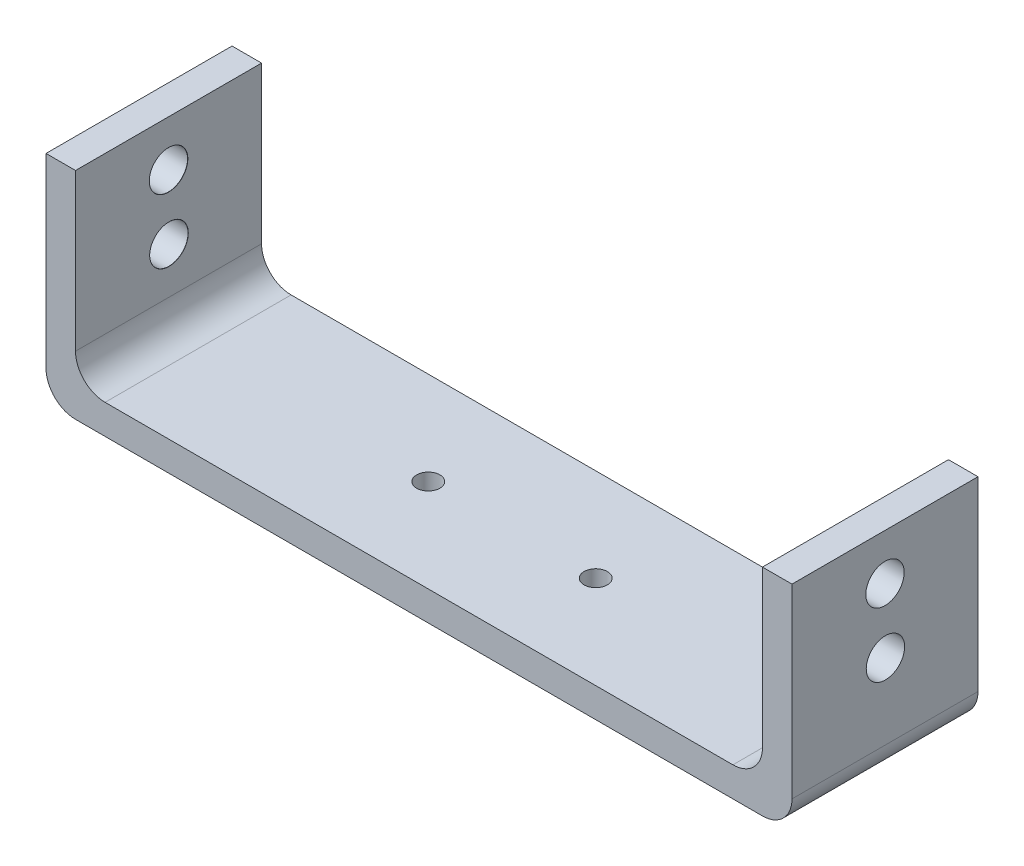
ISO-10303-21;
HEADER;
FILE_DESCRIPTION(('STEP AP214'),'2;1');
FILE_NAME('part.step','',(''),(''),'','','');
FILE_SCHEMA(('AUTOMOTIVE_DESIGN { 1 0 10303 214 1 1 1 1 }'));
ENDSEC;
DATA;
#1=APPLICATION_CONTEXT('core data for automotive mechanical design processes');
#2=APPLICATION_PROTOCOL_DEFINITION('international standard','automotive_design',2000,#1);
#3=PRODUCT_CONTEXT('',#1,'mechanical');
#4=PRODUCT('Part','Part','',(#3));
#5=PRODUCT_RELATED_PRODUCT_CATEGORY('part','',(#4));
#6=PRODUCT_DEFINITION_FORMATION('','',#4);
#7=PRODUCT_DEFINITION_CONTEXT('part definition',#1,'design');
#8=PRODUCT_DEFINITION('design','',#6,#7);
#9=PRODUCT_DEFINITION_SHAPE('','',#8);
#10=(LENGTH_UNIT() NAMED_UNIT(*) SI_UNIT(.MILLI.,.METRE.));
#11=(NAMED_UNIT(*) PLANE_ANGLE_UNIT() SI_UNIT($,.RADIAN.));
#12=(NAMED_UNIT(*) SI_UNIT($,.STERADIAN.) SOLID_ANGLE_UNIT());
#13=UNCERTAINTY_MEASURE_WITH_UNIT(LENGTH_MEASURE(1.E-05),#10,'distance_accuracy_value','');
#14=(GEOMETRIC_REPRESENTATION_CONTEXT(3) GLOBAL_UNCERTAINTY_ASSIGNED_CONTEXT((#13)) GLOBAL_UNIT_ASSIGNED_CONTEXT((#10,
#11,#12)) REPRESENTATION_CONTEXT('',''));
#15=CARTESIAN_POINT('',(0.,0.,0.));
#16=DIRECTION('',(0.,0.,1.));
#17=DIRECTION('',(1.,0.,0.));
#18=AXIS2_PLACEMENT_3D('',#15,#16,#17);
#19=CARTESIAN_POINT('',(-154.05,6.35,0.));
#20=DIRECTION('',(0.,0.,-1.));
#21=DIRECTION('',(-1.,0.,0.));
#22=AXIS2_PLACEMENT_3D('',#19,#20,#21);
#23=PLANE('',#22);
#24=DIRECTION('',(0.,-1.,0.));
#25=VECTOR('',#24,1.);
#26=CARTESIAN_POINT('',(-160.4,6.35,0.));
#27=LINE('',#26,#25);
#28=CARTESIAN_POINT('',(-160.4,46.35,0.));
#29=VERTEX_POINT('',#28);
#30=CARTESIAN_POINT('',(-160.4,6.35,0.));
#31=VERTEX_POINT('',#30);
#32=EDGE_CURVE('E144',#29,#31,#27,.T.);
#33=ORIENTED_EDGE('',*,*,#32,.T.);
#34=CARTESIAN_POINT('',(-154.05,6.35,0.));
#35=DIRECTION('',(0.,0.,-1.));
#36=DIRECTION('',(-1.,0.,0.));
#37=AXIS2_PLACEMENT_3D('',#34,#35,#36);
#38=CIRCLE('',#37,6.35);
#39=CARTESIAN_POINT('',(-154.05,0.,0.));
#40=VERTEX_POINT('',#39);
#41=EDGE_CURVE('E284',#31,#40,#38,.F.);
#42=ORIENTED_EDGE('',*,*,#41,.T.);
#43=DIRECTION('',(1.,0.,0.));
#44=VECTOR('',#43,1.);
#45=CARTESIAN_POINT('',(-154.05,0.,0.));
#46=LINE('',#45,#44);
#47=CARTESIAN_POINT('',(-6.34999999999999,0.,0.));
#48=VERTEX_POINT('',#47);
#49=EDGE_CURVE('E225',#40,#48,#46,.T.);
#50=ORIENTED_EDGE('',*,*,#49,.T.);
#51=CARTESIAN_POINT('',(-6.35,6.35,0.));
#52=DIRECTION('',(0.,0.,-1.));
#53=DIRECTION('',(-1.,0.,0.));
#54=AXIS2_PLACEMENT_3D('',#51,#52,#53);
#55=CIRCLE('',#54,6.35);
#56=CARTESIAN_POINT('',(0.,6.35,0.));
#57=VERTEX_POINT('',#56);
#58=EDGE_CURVE('E257',#48,#57,#55,.F.);
#59=ORIENTED_EDGE('',*,*,#58,.T.);
#60=DIRECTION('',(0.,-1.,0.));
#61=VECTOR('',#60,1.);
#62=CARTESIAN_POINT('',(0.,6.35,0.));
#63=LINE('',#62,#61);
#64=CARTESIAN_POINT('',(0.,46.35,0.));
#65=VERTEX_POINT('',#64);
#66=EDGE_CURVE('E242',#65,#57,#63,.T.);
#67=ORIENTED_EDGE('',*,*,#66,.F.);
#68=DIRECTION('',(1.,0.,0.));
#69=VECTOR('',#68,1.);
#70=CARTESIAN_POINT('',(-6.35,46.35,0.));
#71=LINE('',#70,#69);
#72=CARTESIAN_POINT('',(-6.35,46.35,0.));
#73=VERTEX_POINT('',#72);
#74=EDGE_CURVE('E206',#73,#65,#71,.T.);
#75=ORIENTED_EDGE('',*,*,#74,.F.);
#76=DIRECTION('',(0.,-1.,0.));
#77=VECTOR('',#76,1.);
#78=CARTESIAN_POINT('',(-6.35,46.35,0.));
#79=LINE('',#78,#77);
#80=CARTESIAN_POINT('',(-6.35,12.7,0.));
#81=VERTEX_POINT('',#80);
#82=EDGE_CURVE('E221',#73,#81,#79,.T.);
#83=ORIENTED_EDGE('',*,*,#82,.T.);
#84=CARTESIAN_POINT('',(-12.7,12.7,0.));
#85=DIRECTION('',(0.,0.,-1.));
#86=DIRECTION('',(-1.,0.,0.));
#87=AXIS2_PLACEMENT_3D('',#84,#85,#86);
#88=CIRCLE('',#87,6.35);
#89=CARTESIAN_POINT('',(-12.7,6.35,0.));
#90=VERTEX_POINT('',#89);
#91=EDGE_CURVE('E267',#81,#90,#88,.T.);
#92=ORIENTED_EDGE('',*,*,#91,.T.);
#93=DIRECTION('',(1.,0.,0.));
#94=VECTOR('',#93,1.);
#95=CARTESIAN_POINT('',(-154.05,6.35,0.));
#96=LINE('',#95,#94);
#97=CARTESIAN_POINT('',(-147.7,6.35,0.));
#98=VERTEX_POINT('',#97);
#99=EDGE_CURVE('E226',#98,#90,#96,.T.);
#100=ORIENTED_EDGE('',*,*,#99,.F.);
#101=CARTESIAN_POINT('',(-147.7,12.7,0.));
#102=DIRECTION('',(0.,0.,-1.));
#103=DIRECTION('',(-1.,0.,0.));
#104=AXIS2_PLACEMENT_3D('',#101,#102,#103);
#105=CIRCLE('',#104,6.35);
#106=CARTESIAN_POINT('',(-154.05,12.7,0.));
#107=VERTEX_POINT('',#106);
#108=EDGE_CURVE('E54',#98,#107,#105,.T.);
#109=ORIENTED_EDGE('',*,*,#108,.T.);
#110=DIRECTION('',(0.,-1.,0.));
#111=VECTOR('',#110,1.);
#112=CARTESIAN_POINT('',(-154.05,46.35,0.));
#113=LINE('',#112,#111);
#114=CARTESIAN_POINT('',(-154.05,46.35,0.));
#115=VERTEX_POINT('',#114);
#116=EDGE_CURVE('E145',#115,#107,#113,.T.);
#117=ORIENTED_EDGE('',*,*,#116,.F.);
#118=DIRECTION('',(-1.,0.,0.));
#119=VECTOR('',#118,1.);
#120=CARTESIAN_POINT('',(-154.05,46.35,0.));
#121=LINE('',#120,#119);
#122=EDGE_CURVE('E154',#115,#29,#121,.T.);
#123=ORIENTED_EDGE('',*,*,#122,.T.);
#124=EDGE_LOOP('',(#33,#42,#50,#59,#67,#75,#83,#92,#100,#109,#117,#123));
#125=FACE_BOUND('',#124,.T.);
#126=ADVANCED_FACE('F44',(#125),#23,.F.);
#127=CARTESIAN_POINT('',(0.,6.35,-40.));
#128=DIRECTION('',(-1.,0.,0.));
#129=DIRECTION('',(0.,0.,1.));
#130=AXIS2_PLACEMENT_3D('',#127,#128,#129);
#131=PLANE('',#130);
#132=CARTESIAN_POINT('',(0.,36.467,-20.));
#133=DIRECTION('',(-1.,0.,0.));
#134=DIRECTION('',(0.,0.,1.));
#135=AXIS2_PLACEMENT_3D('',#132,#133,#134);
#136=CIRCLE('',#135,4.125);
#137=CARTESIAN_POINT('',(0.,36.467,-15.875));
#138=VERTEX_POINT('',#137);
#139=EDGE_CURVE('E186',#138,#138,#136,.T.);
#140=ORIENTED_EDGE('',*,*,#139,.T.);
#141=EDGE_LOOP('',(#140));
#142=FACE_BOUND('',#141,.T.);
#143=CARTESIAN_POINT('',(0.,22.583,-20.0935290964698));
#144=DIRECTION('',(-1.,0.,0.));
#145=DIRECTION('',(0.,0.,1.));
#146=AXIS2_PLACEMENT_3D('',#143,#144,#145);
#147=CIRCLE('',#146,4.125);
#148=CARTESIAN_POINT('',(0.,22.583,-15.9685290964698));
#149=VERTEX_POINT('',#148);
#150=EDGE_CURVE('E198',#149,#149,#147,.T.);
#151=ORIENTED_EDGE('',*,*,#150,.T.);
#152=EDGE_LOOP('',(#151));
#153=FACE_BOUND('',#152,.T.);
#154=ORIENTED_EDGE('',*,*,#66,.T.);
#155=DIRECTION('',(0.,0.,-1.));
#156=VECTOR('',#155,1.);
#157=CARTESIAN_POINT('',(0.,6.35,-40.));
#158=LINE('',#157,#156);
#159=CARTESIAN_POINT('',(0.,6.35,-40.));
#160=VERTEX_POINT('',#159);
#161=EDGE_CURVE('E246',#57,#160,#158,.T.);
#162=ORIENTED_EDGE('',*,*,#161,.T.);
#163=DIRECTION('',(0.,-1.,0.));
#164=VECTOR('',#163,1.);
#165=CARTESIAN_POINT('',(0.,6.35,-40.));
#166=LINE('',#165,#164);
#167=CARTESIAN_POINT('',(0.,46.35,-40.));
#168=VERTEX_POINT('',#167);
#169=EDGE_CURVE('E234',#168,#160,#166,.T.);
#170=ORIENTED_EDGE('',*,*,#169,.F.);
#171=DIRECTION('',(0.,0.,-1.));
#172=VECTOR('',#171,1.);
#173=CARTESIAN_POINT('',(0.,46.35,-40.));
#174=LINE('',#173,#172);
#175=EDGE_CURVE('E210',#65,#168,#174,.T.);
#176=ORIENTED_EDGE('',*,*,#175,.F.);
#177=EDGE_LOOP('',(#154,#162,#170,#176));
#178=FACE_BOUND('',#177,.T.);
#179=ADVANCED_FACE('F364',(#142,#153,#178),#131,.F.);
#180=CARTESIAN_POINT('',(-154.05,6.35,-40.));
#181=DIRECTION('',(0.,0.,1.));
#182=DIRECTION('',(1.,0.,0.));
#183=AXIS2_PLACEMENT_3D('',#180,#181,#182);
#184=PLANE('',#183);
#185=DIRECTION('',(-1.,0.,0.));
#186=VECTOR('',#185,1.);
#187=CARTESIAN_POINT('',(-154.05,0.,-40.));
#188=LINE('',#187,#186);
#189=CARTESIAN_POINT('',(-6.34999999999999,0.,-40.));
#190=VERTEX_POINT('',#189);
#191=CARTESIAN_POINT('',(-154.05,0.,-40.));
#192=VERTEX_POINT('',#191);
#193=EDGE_CURVE('E230',#190,#192,#188,.T.);
#194=ORIENTED_EDGE('',*,*,#193,.T.);
#195=CARTESIAN_POINT('',(-154.05,6.35,-40.));
#196=DIRECTION('',(0.,0.,1.));
#197=DIRECTION('',(1.,0.,0.));
#198=AXIS2_PLACEMENT_3D('',#195,#196,#197);
#199=CIRCLE('',#198,6.35);
#200=CARTESIAN_POINT('',(-160.4,6.35,-40.));
#201=VERTEX_POINT('',#200);
#202=EDGE_CURVE('E278',#192,#201,#199,.F.);
#203=ORIENTED_EDGE('',*,*,#202,.T.);
#204=DIRECTION('',(0.,-1.,0.));
#205=VECTOR('',#204,1.);
#206=CARTESIAN_POINT('',(-160.4,6.35,-40.));
#207=LINE('',#206,#205);
#208=CARTESIAN_POINT('',(-160.4,46.35,-40.));
#209=VERTEX_POINT('',#208);
#210=EDGE_CURVE('E161',#209,#201,#207,.T.);
#211=ORIENTED_EDGE('',*,*,#210,.F.);
#212=DIRECTION('',(1.,0.,0.));
#213=VECTOR('',#212,1.);
#214=CARTESIAN_POINT('',(-154.05,46.35,-40.));
#215=LINE('',#214,#213);
#216=CARTESIAN_POINT('',(-154.05,46.35,-40.));
#217=VERTEX_POINT('',#216);
#218=EDGE_CURVE('E151',#209,#217,#215,.T.);
#219=ORIENTED_EDGE('',*,*,#218,.T.);
#220=DIRECTION('',(0.,-1.,0.));
#221=VECTOR('',#220,1.);
#222=CARTESIAN_POINT('',(-154.05,46.35,-40.));
#223=LINE('',#222,#221);
#224=CARTESIAN_POINT('',(-154.05,12.7,-40.));
#225=VERTEX_POINT('',#224);
#226=EDGE_CURVE('E134',#217,#225,#223,.T.);
#227=ORIENTED_EDGE('',*,*,#226,.T.);
#228=CARTESIAN_POINT('',(-147.7,12.7,-40.));
#229=DIRECTION('',(0.,0.,1.));
#230=DIRECTION('',(1.,0.,0.));
#231=AXIS2_PLACEMENT_3D('',#228,#229,#230);
#232=CIRCLE('',#231,6.35);
#233=CARTESIAN_POINT('',(-147.7,6.35,-40.));
#234=VERTEX_POINT('',#233);
#235=EDGE_CURVE('E11',#225,#234,#232,.T.);
#236=ORIENTED_EDGE('',*,*,#235,.T.);
#237=DIRECTION('',(-1.,0.,0.));
#238=VECTOR('',#237,1.);
#239=CARTESIAN_POINT('',(-154.05,6.35,-40.));
#240=LINE('',#239,#238);
#241=CARTESIAN_POINT('',(-12.7,6.35,-40.));
#242=VERTEX_POINT('',#241);
#243=EDGE_CURVE('E229',#242,#234,#240,.T.);
#244=ORIENTED_EDGE('',*,*,#243,.F.);
#245=CARTESIAN_POINT('',(-12.7,12.7,-40.));
#246=DIRECTION('',(0.,0.,1.));
#247=DIRECTION('',(1.,0.,0.));
#248=AXIS2_PLACEMENT_3D('',#245,#246,#247);
#249=CIRCLE('',#248,6.35);
#250=CARTESIAN_POINT('',(-6.35,12.7,-40.));
#251=VERTEX_POINT('',#250);
#252=EDGE_CURVE('E271',#242,#251,#249,.T.);
#253=ORIENTED_EDGE('',*,*,#252,.T.);
#254=DIRECTION('',(0.,-1.,0.));
#255=VECTOR('',#254,1.);
#256=CARTESIAN_POINT('',(-6.35,46.35,-40.));
#257=LINE('',#256,#255);
#258=CARTESIAN_POINT('',(-6.35,46.35,-40.));
#259=VERTEX_POINT('',#258);
#260=EDGE_CURVE('E217',#259,#251,#257,.T.);
#261=ORIENTED_EDGE('',*,*,#260,.F.);
#262=DIRECTION('',(-1.,0.,0.));
#263=VECTOR('',#262,1.);
#264=CARTESIAN_POINT('',(-6.35,46.35,-40.));
#265=LINE('',#264,#263);
#266=EDGE_CURVE('E214',#168,#259,#265,.T.);
#267=ORIENTED_EDGE('',*,*,#266,.F.);
#268=ORIENTED_EDGE('',*,*,#169,.T.);
#269=CARTESIAN_POINT('',(-6.35,6.35,-40.));
#270=DIRECTION('',(0.,0.,1.));
#271=DIRECTION('',(1.,0.,0.));
#272=AXIS2_PLACEMENT_3D('',#269,#270,#271);
#273=CIRCLE('',#272,6.35);
#274=EDGE_CURVE('E250',#160,#190,#273,.F.);
#275=ORIENTED_EDGE('',*,*,#274,.T.);
#276=EDGE_LOOP('',(#194,#203,#211,#219,#227,#236,#244,#253,#261,#267,#268,#275));
#277=FACE_BOUND('',#276,.T.);
#278=ADVANCED_FACE('F159',(#277),#184,.F.);
#279=CARTESIAN_POINT('',(0.,6.35,0.));
#280=DIRECTION('',(0.,1.,0.));
#281=DIRECTION('',(0.,0.,1.));
#282=AXIS2_PLACEMENT_3D('',#279,#280,#281);
#283=PLANE('',#282);
#284=CARTESIAN_POINT('',(-98.2,6.35,-20.));
#285=DIRECTION('',(0.,1.,0.));
#286=DIRECTION('',(0.,0.,1.));
#287=AXIS2_PLACEMENT_3D('',#284,#285,#286);
#288=CIRCLE('',#287,2.5);
#289=CARTESIAN_POINT('',(-98.2,6.35,-17.5));
#290=VERTEX_POINT('',#289);
#291=EDGE_CURVE('E296',#290,#290,#288,.T.);
#292=ORIENTED_EDGE('',*,*,#291,.F.);
#293=EDGE_LOOP('',(#292));
#294=FACE_BOUND('',#293,.T.);
#295=CARTESIAN_POINT('',(-62.2,6.35,-20.));
#296=DIRECTION('',(0.,1.,0.));
#297=DIRECTION('',(0.,0.,1.));
#298=AXIS2_PLACEMENT_3D('',#295,#296,#297);
#299=CIRCLE('',#298,2.50000000000001);
#300=CARTESIAN_POINT('',(-62.2,6.35,-17.5));
#301=VERTEX_POINT('',#300);
#302=EDGE_CURVE('E304',#301,#301,#299,.T.);
#303=ORIENTED_EDGE('',*,*,#302,.F.);
#304=EDGE_LOOP('',(#303));
#305=FACE_BOUND('',#304,.T.);
#306=ORIENTED_EDGE('',*,*,#243,.T.);
#307=DIRECTION('',(0.,0.,1.));
#308=VECTOR('',#307,1.);
#309=CARTESIAN_POINT('',(-147.7,6.35,0.));
#310=LINE('',#309,#308);
#311=EDGE_CURVE('E287',#234,#98,#310,.T.);
#312=ORIENTED_EDGE('',*,*,#311,.T.);
#313=ORIENTED_EDGE('',*,*,#99,.T.);
#314=DIRECTION('',(0.,0.,1.));
#315=VECTOR('',#314,1.);
#316=CARTESIAN_POINT('',(-12.7,6.35,0.));
#317=LINE('',#316,#315);
#318=EDGE_CURVE('E264',#90,#242,#317,.F.);
#319=ORIENTED_EDGE('',*,*,#318,.T.);
#320=EDGE_LOOP('',(#306,#312,#313,#319));
#321=FACE_BOUND('',#320,.T.);
#322=ADVANCED_FACE('F411',(#294,#305,#321),#283,.T.);
#323=CARTESIAN_POINT('',(0.,0.,0.));
#324=DIRECTION('',(0.,1.,0.));
#325=DIRECTION('',(0.,0.,1.));
#326=AXIS2_PLACEMENT_3D('',#323,#324,#325);
#327=PLANE('',#326);
#328=CARTESIAN_POINT('',(-98.2,0.,-20.));
#329=DIRECTION('',(0.,1.,0.));
#330=DIRECTION('',(0.,0.,1.));
#331=AXIS2_PLACEMENT_3D('',#328,#329,#330);
#332=CIRCLE('',#331,2.5);
#333=CARTESIAN_POINT('',(-98.2,0.,-17.5));
#334=VERTEX_POINT('',#333);
#335=EDGE_CURVE('E48',#334,#334,#332,.T.);
#336=ORIENTED_EDGE('',*,*,#335,.T.);
#337=EDGE_LOOP('',(#336));
#338=FACE_BOUND('',#337,.T.);
#339=CARTESIAN_POINT('',(-62.2,0.,-20.));
#340=DIRECTION('',(0.,1.,0.));
#341=DIRECTION('',(0.,0.,1.));
#342=AXIS2_PLACEMENT_3D('',#339,#340,#341);
#343=CIRCLE('',#342,2.50000000000001);
#344=CARTESIAN_POINT('',(-62.2,0.,-17.5));
#345=VERTEX_POINT('',#344);
#346=EDGE_CURVE('E293',#345,#345,#343,.T.);
#347=ORIENTED_EDGE('',*,*,#346,.T.);
#348=EDGE_LOOP('',(#347));
#349=FACE_BOUND('',#348,.T.);
#350=ORIENTED_EDGE('',*,*,#49,.F.);
#351=DIRECTION('',(0.,0.,-1.));
#352=VECTOR('',#351,1.);
#353=CARTESIAN_POINT('',(-154.05,0.,-40.));
#354=LINE('',#353,#352);
#355=EDGE_CURVE('E274',#40,#192,#354,.T.);
#356=ORIENTED_EDGE('',*,*,#355,.T.);
#357=ORIENTED_EDGE('',*,*,#193,.F.);
#358=DIRECTION('',(0.,0.,-1.));
#359=VECTOR('',#358,1.);
#360=CARTESIAN_POINT('',(-6.35,0.,0.));
#361=LINE('',#360,#359);
#362=EDGE_CURVE('E253',#190,#48,#361,.F.);
#363=ORIENTED_EDGE('',*,*,#362,.T.);
#364=EDGE_LOOP('',(#350,#356,#357,#363));
#365=FACE_BOUND('',#364,.T.);
#366=ADVANCED_FACE('F392',(#338,#349,#365),#327,.F.);
#367=CARTESIAN_POINT('',(-6.35,46.35,-40.));
#368=DIRECTION('',(1.,0.,0.));
#369=DIRECTION('',(0.,0.,-1.));
#370=AXIS2_PLACEMENT_3D('',#367,#368,#369);
#371=PLANE('',#370);
#372=CARTESIAN_POINT('',(-6.35,36.467,-20.));
#373=DIRECTION('',(-1.,0.,0.));
#374=DIRECTION('',(0.,0.,1.));
#375=AXIS2_PLACEMENT_3D('',#372,#373,#374);
#376=CIRCLE('',#375,4.15);
#377=CARTESIAN_POINT('',(-6.35,36.467,-15.85));
#378=VERTEX_POINT('',#377);
#379=EDGE_CURVE('E178',#378,#378,#376,.T.);
#380=ORIENTED_EDGE('',*,*,#379,.F.);
#381=EDGE_LOOP('',(#380));
#382=FACE_BOUND('',#381,.T.);
#383=CARTESIAN_POINT('',(-6.35,22.583,-20.0935290964698));
#384=DIRECTION('',(-1.,0.,0.));
#385=DIRECTION('',(0.,0.,1.));
#386=AXIS2_PLACEMENT_3D('',#383,#384,#385);
#387=CIRCLE('',#386,4.15);
#388=CARTESIAN_POINT('',(-6.35,22.583,-15.9435290964698));
#389=VERTEX_POINT('',#388);
#390=EDGE_CURVE('E190',#389,#389,#387,.T.);
#391=ORIENTED_EDGE('',*,*,#390,.F.);
#392=EDGE_LOOP('',(#391));
#393=FACE_BOUND('',#392,.T.);
#394=ORIENTED_EDGE('',*,*,#260,.T.);
#395=DIRECTION('',(0.,0.,1.));
#396=VECTOR('',#395,1.);
#397=CARTESIAN_POINT('',(-6.35,12.7,-40.));
#398=LINE('',#397,#396);
#399=EDGE_CURVE('E260',#251,#81,#398,.T.);
#400=ORIENTED_EDGE('',*,*,#399,.T.);
#401=ORIENTED_EDGE('',*,*,#82,.F.);
#402=DIRECTION('',(0.,0.,1.));
#403=VECTOR('',#402,1.);
#404=CARTESIAN_POINT('',(-6.35,46.35,-40.));
#405=LINE('',#404,#403);
#406=EDGE_CURVE('E202',#259,#73,#405,.T.);
#407=ORIENTED_EDGE('',*,*,#406,.F.);
#408=EDGE_LOOP('',(#394,#400,#401,#407));
#409=FACE_BOUND('',#408,.T.);
#410=ADVANCED_FACE('F408',(#382,#393,#409),#371,.F.);
#411=CARTESIAN_POINT('',(0.,46.35,0.));
#412=DIRECTION('',(0.,1.,0.));
#413=DIRECTION('',(0.,0.,1.));
#414=AXIS2_PLACEMENT_3D('',#411,#412,#413);
#415=PLANE('',#414);
#416=ORIENTED_EDGE('',*,*,#406,.T.);
#417=ORIENTED_EDGE('',*,*,#74,.T.);
#418=ORIENTED_EDGE('',*,*,#175,.T.);
#419=ORIENTED_EDGE('',*,*,#266,.T.);
#420=EDGE_LOOP('',(#416,#417,#418,#419));
#421=FACE_BOUND('',#420,.T.);
#422=ADVANCED_FACE('F377',(#421),#415,.T.);
#423=CARTESIAN_POINT('',(-6.35,6.35,-40.));
#424=DIRECTION('',(0.,0.,-1.));
#425=DIRECTION('',(-1.,0.,0.));
#426=AXIS2_PLACEMENT_3D('',#423,#424,#425);
#427=CYLINDRICAL_SURFACE('',#426,6.35);
#428=ORIENTED_EDGE('',*,*,#58,.F.);
#429=ORIENTED_EDGE('',*,*,#362,.F.);
#430=ORIENTED_EDGE('',*,*,#274,.F.);
#431=ORIENTED_EDGE('',*,*,#161,.F.);
#432=EDGE_LOOP('',(#428,#429,#430,#431));
#433=FACE_BOUND('',#432,.T.);
#434=ADVANCED_FACE('F373',(#433),#427,.T.);
#435=CARTESIAN_POINT('',(-12.7,12.7,-40.));
#436=DIRECTION('',(0.,0.,1.));
#437=DIRECTION('',(1.,0.,0.));
#438=AXIS2_PLACEMENT_3D('',#435,#436,#437);
#439=CYLINDRICAL_SURFACE('',#438,6.35);
#440=ORIENTED_EDGE('',*,*,#252,.F.);
#441=ORIENTED_EDGE('',*,*,#318,.F.);
#442=ORIENTED_EDGE('',*,*,#91,.F.);
#443=ORIENTED_EDGE('',*,*,#399,.F.);
#444=EDGE_LOOP('',(#440,#441,#442,#443));
#445=FACE_BOUND('',#444,.T.);
#446=ADVANCED_FACE('F376',(#445),#439,.F.);
#447=CARTESIAN_POINT('',(-6.35,22.583,-20.0935290964698));
#448=DIRECTION('',(-1.,0.,0.));
#449=DIRECTION('',(0.,0.,1.));
#450=AXIS2_PLACEMENT_3D('',#447,#448,#449);
#451=CYLINDRICAL_SURFACE('',#450,4.12499999999999);
#452=ORIENTED_EDGE('',*,*,#150,.F.);
#453=EDGE_LOOP('',(#452));
#454=FACE_BOUND('',#453,.T.);
#455=CARTESIAN_POINT('',(-6.32499999999997,22.583,-20.0935290964698));
#456=DIRECTION('',(-1.,0.,0.));
#457=DIRECTION('',(0.,0.,1.));
#458=AXIS2_PLACEMENT_3D('',#455,#456,#457);
#459=CIRCLE('',#458,4.12499999999999);
#460=CARTESIAN_POINT('',(-6.32499999999997,22.583,-15.9685290964698));
#461=VERTEX_POINT('',#460);
#462=EDGE_CURVE('E194',#461,#461,#459,.T.);
#463=ORIENTED_EDGE('',*,*,#462,.T.);
#464=EDGE_LOOP('',(#463));
#465=FACE_BOUND('',#464,.T.);
#466=ADVANCED_FACE('F380',(#454,#465),#451,.F.);
#467=CARTESIAN_POINT('',(-6.35,22.583,-20.0935290964698));
#468=DIRECTION('',(-1.,0.,0.));
#469=DIRECTION('',(0.,0.,1.));
#470=AXIS2_PLACEMENT_3D('',#467,#468,#469);
#471=CONICAL_SURFACE('',#470,4.15,0.785398163397205);
#472=ORIENTED_EDGE('',*,*,#462,.F.);
#473=EDGE_LOOP('',(#472));
#474=FACE_BOUND('',#473,.T.);
#475=ORIENTED_EDGE('',*,*,#390,.T.);
#476=EDGE_LOOP('',(#475));
#477=FACE_BOUND('',#476,.T.);
#478=ADVANCED_FACE('F431',(#474,#477),#471,.F.);
#479=CARTESIAN_POINT('',(-6.35,36.467,-20.));
#480=DIRECTION('',(-1.,0.,0.));
#481=DIRECTION('',(0.,0.,1.));
#482=AXIS2_PLACEMENT_3D('',#479,#480,#481);
#483=CYLINDRICAL_SURFACE('',#482,4.125);
#484=ORIENTED_EDGE('',*,*,#139,.F.);
#485=EDGE_LOOP('',(#484));
#486=FACE_BOUND('',#485,.T.);
#487=CARTESIAN_POINT('',(-6.32499999999997,36.467,-20.));
#488=DIRECTION('',(-1.,0.,0.));
#489=DIRECTION('',(0.,0.,1.));
#490=AXIS2_PLACEMENT_3D('',#487,#488,#489);
#491=CIRCLE('',#490,4.12499999999999);
#492=CARTESIAN_POINT('',(-6.32499999999997,36.467,-15.875));
#493=VERTEX_POINT('',#492);
#494=EDGE_CURVE('E182',#493,#493,#491,.T.);
#495=ORIENTED_EDGE('',*,*,#494,.T.);
#496=EDGE_LOOP('',(#495));
#497=FACE_BOUND('',#496,.T.);
#498=ADVANCED_FACE('F435',(#486,#497),#483,.F.);
#499=CARTESIAN_POINT('',(-6.35,36.467,-20.));
#500=DIRECTION('',(-1.,0.,0.));
#501=DIRECTION('',(0.,0.,1.));
#502=AXIS2_PLACEMENT_3D('',#499,#500,#501);
#503=CONICAL_SURFACE('',#502,4.15,0.785398163397136);
#504=ORIENTED_EDGE('',*,*,#494,.F.);
#505=EDGE_LOOP('',(#504));
#506=FACE_BOUND('',#505,.T.);
#507=ORIENTED_EDGE('',*,*,#379,.T.);
#508=EDGE_LOOP('',(#507));
#509=FACE_BOUND('',#508,.T.);
#510=ADVANCED_FACE('F359',(#506,#509),#503,.F.);
#511=CARTESIAN_POINT('',(-160.4,6.35,-40.));
#512=DIRECTION('',(-1.,0.,0.));
#513=DIRECTION('',(0.,0.,1.));
#514=AXIS2_PLACEMENT_3D('',#511,#512,#513);
#515=PLANE('',#514);
#516=CARTESIAN_POINT('',(-160.4,36.467,-20.));
#517=DIRECTION('',(1.,0.,0.));
#518=DIRECTION('',(0.,0.,-1.));
#519=AXIS2_PLACEMENT_3D('',#516,#517,#518);
#520=CIRCLE('',#519,4.125);
#521=CARTESIAN_POINT('',(-160.4,36.467,-24.125));
#522=VERTEX_POINT('',#521);
#523=EDGE_CURVE('E319',#522,#522,#520,.T.);
#524=ORIENTED_EDGE('',*,*,#523,.T.);
#525=EDGE_LOOP('',(#524));
#526=FACE_BOUND('',#525,.T.);
#527=CARTESIAN_POINT('',(-160.4,22.583,-20.0935290964697));
#528=DIRECTION('',(1.,0.,0.));
#529=DIRECTION('',(0.,0.,-1.));
#530=AXIS2_PLACEMENT_3D('',#527,#528,#529);
#531=CIRCLE('',#530,4.125);
#532=CARTESIAN_POINT('',(-160.4,22.583,-24.2185290964697));
#533=VERTEX_POINT('',#532);
#534=EDGE_CURVE('E156',#533,#533,#531,.T.);
#535=ORIENTED_EDGE('',*,*,#534,.T.);
#536=EDGE_LOOP('',(#535));
#537=FACE_BOUND('',#536,.T.);
#538=ORIENTED_EDGE('',*,*,#210,.T.);
#539=DIRECTION('',(0.,0.,-1.));
#540=VECTOR('',#539,1.);
#541=CARTESIAN_POINT('',(-160.4,6.35,0.));
#542=LINE('',#541,#540);
#543=EDGE_CURVE('E281',#201,#31,#542,.F.);
#544=ORIENTED_EDGE('',*,*,#543,.T.);
#545=ORIENTED_EDGE('',*,*,#32,.F.);
#546=DIRECTION('',(0.,0.,-1.));
#547=VECTOR('',#546,1.);
#548=CARTESIAN_POINT('',(-160.4,46.35,-40.));
#549=LINE('',#548,#547);
#550=EDGE_CURVE('E163',#29,#209,#549,.T.);
#551=ORIENTED_EDGE('',*,*,#550,.T.);
#552=EDGE_LOOP('',(#538,#544,#545,#551));
#553=FACE_BOUND('',#552,.T.);
#554=ADVANCED_FACE('F334',(#526,#537,#553),#515,.T.);
#555=CARTESIAN_POINT('',(-154.05,46.35,-40.));
#556=DIRECTION('',(1.,0.,0.));
#557=DIRECTION('',(0.,0.,-1.));
#558=AXIS2_PLACEMENT_3D('',#555,#556,#557);
#559=PLANE('',#558);
#560=CARTESIAN_POINT('',(-154.05,36.467,-20.));
#561=DIRECTION('',(1.,0.,0.));
#562=DIRECTION('',(0.,0.,-1.));
#563=AXIS2_PLACEMENT_3D('',#560,#561,#562);
#564=CIRCLE('',#563,4.15);
#565=CARTESIAN_POINT('',(-154.05,36.467,-24.15));
#566=VERTEX_POINT('',#565);
#567=EDGE_CURVE('E302',#566,#566,#564,.T.);
#568=ORIENTED_EDGE('',*,*,#567,.F.);
#569=EDGE_LOOP('',(#568));
#570=FACE_BOUND('',#569,.T.);
#571=CARTESIAN_POINT('',(-154.05,22.583,-20.0935290964697));
#572=DIRECTION('',(1.,0.,0.));
#573=DIRECTION('',(0.,0.,-1.));
#574=AXIS2_PLACEMENT_3D('',#571,#572,#573);
#575=CIRCLE('',#574,4.15);
#576=CARTESIAN_POINT('',(-154.05,22.583,-24.2435290964697));
#577=VERTEX_POINT('',#576);
#578=EDGE_CURVE('E323',#577,#577,#575,.T.);
#579=ORIENTED_EDGE('',*,*,#578,.F.);
#580=EDGE_LOOP('',(#579));
#581=FACE_BOUND('',#580,.T.);
#582=ORIENTED_EDGE('',*,*,#116,.T.);
#583=DIRECTION('',(0.,0.,1.));
#584=VECTOR('',#583,1.);
#585=CARTESIAN_POINT('',(-154.05,12.7,-40.));
#586=LINE('',#585,#584);
#587=EDGE_CURVE('E139',#107,#225,#586,.F.);
#588=ORIENTED_EDGE('',*,*,#587,.T.);
#589=ORIENTED_EDGE('',*,*,#226,.F.);
#590=DIRECTION('',(0.,0.,1.));
#591=VECTOR('',#590,1.);
#592=CARTESIAN_POINT('',(-154.05,46.35,-40.));
#593=LINE('',#592,#591);
#594=EDGE_CURVE('E137',#217,#115,#593,.T.);
#595=ORIENTED_EDGE('',*,*,#594,.T.);
#596=EDGE_LOOP('',(#582,#588,#589,#595));
#597=FACE_BOUND('',#596,.T.);
#598=ADVANCED_FACE('F136',(#570,#581,#597),#559,.T.);
#599=CARTESIAN_POINT('',(-160.4,46.35,0.));
#600=DIRECTION('',(0.,1.,0.));
#601=DIRECTION('',(0.,0.,1.));
#602=AXIS2_PLACEMENT_3D('',#599,#600,#601);
#603=PLANE('',#602);
#604=ORIENTED_EDGE('',*,*,#594,.F.);
#605=ORIENTED_EDGE('',*,*,#218,.F.);
#606=ORIENTED_EDGE('',*,*,#550,.F.);
#607=ORIENTED_EDGE('',*,*,#122,.F.);
#608=EDGE_LOOP('',(#604,#605,#606,#607));
#609=FACE_BOUND('',#608,.T.);
#610=ADVANCED_FACE('F149',(#609),#603,.T.);
#611=CARTESIAN_POINT('',(-154.05,6.35,0.));
#612=DIRECTION('',(0.,0.,1.));
#613=DIRECTION('',(1.,0.,0.));
#614=AXIS2_PLACEMENT_3D('',#611,#612,#613);
#615=CYLINDRICAL_SURFACE('',#614,6.35);
#616=ORIENTED_EDGE('',*,*,#41,.F.);
#617=ORIENTED_EDGE('',*,*,#543,.F.);
#618=ORIENTED_EDGE('',*,*,#202,.F.);
#619=ORIENTED_EDGE('',*,*,#355,.F.);
#620=EDGE_LOOP('',(#616,#617,#618,#619));
#621=FACE_BOUND('',#620,.T.);
#622=ADVANCED_FACE('F357',(#621),#615,.T.);
#623=CARTESIAN_POINT('',(-147.7,12.7,0.));
#624=DIRECTION('',(0.,0.,-1.));
#625=DIRECTION('',(-1.,0.,0.));
#626=AXIS2_PLACEMENT_3D('',#623,#624,#625);
#627=CYLINDRICAL_SURFACE('',#626,6.35);
#628=ORIENTED_EDGE('',*,*,#235,.F.);
#629=ORIENTED_EDGE('',*,*,#587,.F.);
#630=ORIENTED_EDGE('',*,*,#108,.F.);
#631=ORIENTED_EDGE('',*,*,#311,.F.);
#632=EDGE_LOOP('',(#628,#629,#630,#631));
#633=FACE_BOUND('',#632,.T.);
#634=ADVANCED_FACE('F46',(#633),#627,.F.);
#635=CARTESIAN_POINT('',(-154.05,22.583,-20.0935290964697));
#636=DIRECTION('',(1.,0.,0.));
#637=DIRECTION('',(0.,0.,-1.));
#638=AXIS2_PLACEMENT_3D('',#635,#636,#637);
#639=CYLINDRICAL_SURFACE('',#638,4.12499999999999);
#640=ORIENTED_EDGE('',*,*,#534,.F.);
#641=EDGE_LOOP('',(#640));
#642=FACE_BOUND('',#641,.T.);
#643=CARTESIAN_POINT('',(-154.075,22.583,-20.0935290964697));
#644=DIRECTION('',(1.,0.,0.));
#645=DIRECTION('',(0.,0.,-1.));
#646=AXIS2_PLACEMENT_3D('',#643,#644,#645);
#647=CIRCLE('',#646,4.12499999999999);
#648=CARTESIAN_POINT('',(-154.075,22.583,-24.2185290964697));
#649=VERTEX_POINT('',#648);
#650=EDGE_CURVE('E327',#649,#649,#647,.T.);
#651=ORIENTED_EDGE('',*,*,#650,.T.);
#652=EDGE_LOOP('',(#651));
#653=FACE_BOUND('',#652,.T.);
#654=ADVANCED_FACE('F337',(#642,#653),#639,.F.);
#655=CARTESIAN_POINT('',(-154.05,22.583,-20.0935290964697));
#656=DIRECTION('',(1.,0.,0.));
#657=DIRECTION('',(0.,0.,-1.));
#658=AXIS2_PLACEMENT_3D('',#655,#656,#657);
#659=CONICAL_SURFACE('',#658,4.15,0.78539816339724);
#660=ORIENTED_EDGE('',*,*,#650,.F.);
#661=EDGE_LOOP('',(#660));
#662=FACE_BOUND('',#661,.T.);
#663=ORIENTED_EDGE('',*,*,#578,.T.);
#664=EDGE_LOOP('',(#663));
#665=FACE_BOUND('',#664,.T.);
#666=ADVANCED_FACE('F340',(#662,#665),#659,.F.);
#667=CARTESIAN_POINT('',(-154.05,36.467,-20.));
#668=DIRECTION('',(1.,0.,0.));
#669=DIRECTION('',(0.,0.,-1.));
#670=AXIS2_PLACEMENT_3D('',#667,#668,#669);
#671=CYLINDRICAL_SURFACE('',#670,4.125);
#672=ORIENTED_EDGE('',*,*,#523,.F.);
#673=EDGE_LOOP('',(#672));
#674=FACE_BOUND('',#673,.T.);
#675=CARTESIAN_POINT('',(-154.075,36.467,-20.));
#676=DIRECTION('',(1.,0.,0.));
#677=DIRECTION('',(0.,0.,-1.));
#678=AXIS2_PLACEMENT_3D('',#675,#676,#677);
#679=CIRCLE('',#678,4.12499999999999);
#680=CARTESIAN_POINT('',(-154.075,36.467,-24.125));
#681=VERTEX_POINT('',#680);
#682=EDGE_CURVE('E315',#681,#681,#679,.T.);
#683=ORIENTED_EDGE('',*,*,#682,.T.);
#684=EDGE_LOOP('',(#683));
#685=FACE_BOUND('',#684,.T.);
#686=ADVANCED_FACE('F346',(#674,#685),#671,.F.);
#687=CARTESIAN_POINT('',(-154.05,36.467,-20.));
#688=DIRECTION('',(1.,0.,0.));
#689=DIRECTION('',(0.,0.,-1.));
#690=AXIS2_PLACEMENT_3D('',#687,#688,#689);
#691=CONICAL_SURFACE('',#690,4.15,0.785398163397171);
#692=ORIENTED_EDGE('',*,*,#682,.F.);
#693=EDGE_LOOP('',(#692));
#694=FACE_BOUND('',#693,.T.);
#695=ORIENTED_EDGE('',*,*,#567,.T.);
#696=EDGE_LOOP('',(#695));
#697=FACE_BOUND('',#696,.T.);
#698=ADVANCED_FACE('F507',(#694,#697),#691,.F.);
#699=CARTESIAN_POINT('',(-62.2,-33.65,-20.));
#700=DIRECTION('',(0.,1.,0.));
#701=DIRECTION('',(0.,0.,1.));
#702=AXIS2_PLACEMENT_3D('',#699,#700,#701);
#703=CYLINDRICAL_SURFACE('',#702,2.50000000000001);
#704=ORIENTED_EDGE('',*,*,#302,.T.);
#705=EDGE_LOOP('',(#704));
#706=FACE_BOUND('',#705,.T.);
#707=ORIENTED_EDGE('',*,*,#346,.F.);
#708=EDGE_LOOP('',(#707));
#709=FACE_BOUND('',#708,.T.);
#710=ADVANCED_FACE('F517',(#706,#709),#703,.F.);
#711=CARTESIAN_POINT('',(-98.2,-33.65,-20.));
#712=DIRECTION('',(0.,1.,0.));
#713=DIRECTION('',(0.,0.,1.));
#714=AXIS2_PLACEMENT_3D('',#711,#712,#713);
#715=CYLINDRICAL_SURFACE('',#714,2.5);
#716=ORIENTED_EDGE('',*,*,#291,.T.);
#717=EDGE_LOOP('',(#716));
#718=FACE_BOUND('',#717,.T.);
#719=ORIENTED_EDGE('',*,*,#335,.F.);
#720=EDGE_LOOP('',(#719));
#721=FACE_BOUND('',#720,.T.);
#722=ADVANCED_FACE('F529',(#718,#721),#715,.F.);
#723=CLOSED_SHELL('',(#126,#179,#278,#322,#366,#410,#422,#434,#446,#466,#478,#498,#510,#554,
#598,#610,#622,#634,#654,#666,#686,#698,#710,#722));
#724=MANIFOLD_SOLID_BREP('B2',#723);
#725=ADVANCED_BREP_SHAPE_REPRESENTATION('',(#18,#724),#14);
#726=SHAPE_DEFINITION_REPRESENTATION(#9,#725);
ENDSEC;
END-ISO-10303-21;
